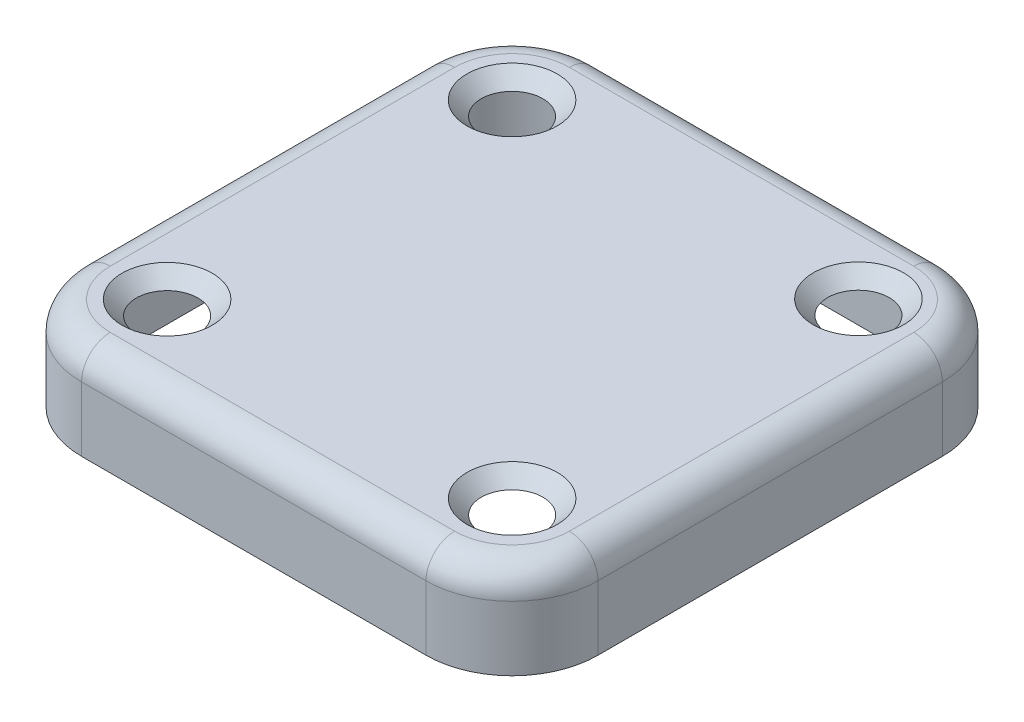
ISO-10303-21;
HEADER;
FILE_DESCRIPTION(('STEP AP214'),'2;1');
FILE_NAME('part.step','',(''),(''),'','','');
FILE_SCHEMA(('AUTOMOTIVE_DESIGN { 1 0 10303 214 1 1 1 1 }'));
ENDSEC;
DATA;
#1=APPLICATION_CONTEXT('core data for automotive mechanical design processes');
#2=APPLICATION_PROTOCOL_DEFINITION('international standard','automotive_design',2000,#1);
#3=PRODUCT_CONTEXT('',#1,'mechanical');
#4=PRODUCT('Part','Part','',(#3));
#5=PRODUCT_RELATED_PRODUCT_CATEGORY('part','',(#4));
#6=PRODUCT_DEFINITION_FORMATION('','',#4);
#7=PRODUCT_DEFINITION_CONTEXT('part definition',#1,'design');
#8=PRODUCT_DEFINITION('design','',#6,#7);
#9=PRODUCT_DEFINITION_SHAPE('','',#8);
#10=(LENGTH_UNIT() NAMED_UNIT(*) SI_UNIT(.MILLI.,.METRE.));
#11=(NAMED_UNIT(*) PLANE_ANGLE_UNIT() SI_UNIT($,.RADIAN.));
#12=(NAMED_UNIT(*) SI_UNIT($,.STERADIAN.) SOLID_ANGLE_UNIT());
#13=UNCERTAINTY_MEASURE_WITH_UNIT(LENGTH_MEASURE(1.E-05),#10,'distance_accuracy_value','');
#14=(GEOMETRIC_REPRESENTATION_CONTEXT(3) GLOBAL_UNCERTAINTY_ASSIGNED_CONTEXT((#13)) GLOBAL_UNIT_ASSIGNED_CONTEXT((#10,
#11,#12)) REPRESENTATION_CONTEXT('',''));
#15=CARTESIAN_POINT('',(0.,0.,0.));
#16=DIRECTION('',(0.,0.,1.));
#17=DIRECTION('',(1.,0.,0.));
#18=AXIS2_PLACEMENT_3D('',#15,#16,#17);
#19=CARTESIAN_POINT('',(12.02,-1.,-12.02));
#20=DIRECTION('',(0.,1.,0.));
#21=DIRECTION('',(0.,0.,1.));
#22=AXIS2_PLACEMENT_3D('',#19,#20,#21);
#23=CYLINDRICAL_SURFACE('',#22,6.);
#24=DIRECTION('',(0.,1.,0.));
#25=VECTOR('',#24,1.);
#26=CARTESIAN_POINT('',(12.02,-1.,-18.02));
#27=LINE('',#26,#25);
#28=CARTESIAN_POINT('',(12.02,-6.5,-18.02));
#29=VERTEX_POINT('',#28);
#30=CARTESIAN_POINT('',(12.02,-2.,-18.02));
#31=VERTEX_POINT('',#30);
#32=EDGE_CURVE('E387',#29,#31,#27,.T.);
#33=ORIENTED_EDGE('',*,*,#32,.T.);
#34=CARTESIAN_POINT('',(12.02,-2.,-12.02));
#35=DIRECTION('',(0.,1.,0.));
#36=DIRECTION('',(0.,0.,1.));
#37=AXIS2_PLACEMENT_3D('',#34,#35,#36);
#38=CIRCLE('',#37,6.);
#39=CARTESIAN_POINT('',(18.02,-2.,-12.02));
#40=VERTEX_POINT('',#39);
#41=EDGE_CURVE('E444',#31,#40,#38,.F.);
#42=ORIENTED_EDGE('',*,*,#41,.T.);
#43=DIRECTION('',(0.,1.,0.));
#44=VECTOR('',#43,1.);
#45=CARTESIAN_POINT('',(18.02,-1.,-12.02));
#46=LINE('',#45,#44);
#47=CARTESIAN_POINT('',(18.02,-6.5,-12.02));
#48=VERTEX_POINT('',#47);
#49=EDGE_CURVE('E388',#48,#40,#46,.T.);
#50=ORIENTED_EDGE('',*,*,#49,.F.);
#51=CARTESIAN_POINT('',(12.02,-6.5,-12.02));
#52=DIRECTION('',(0.,-1.,0.));
#53=DIRECTION('',(0.,0.,-1.));
#54=AXIS2_PLACEMENT_3D('',#51,#52,#53);
#55=CIRCLE('',#54,6.);
#56=EDGE_CURVE('E327',#29,#48,#55,.T.);
#57=ORIENTED_EDGE('',*,*,#56,.F.);
#58=EDGE_LOOP('',(#33,#42,#50,#57));
#59=FACE_BOUND('',#58,.T.);
#60=ADVANCED_FACE('F89',(#59),#23,.T.);
#61=CARTESIAN_POINT('',(18.02,-1.,0.));
#62=DIRECTION('',(-1.,0.,0.));
#63=DIRECTION('',(0.,0.,1.));
#64=AXIS2_PLACEMENT_3D('',#61,#62,#63);
#65=PLANE('',#64);
#66=ORIENTED_EDGE('',*,*,#49,.T.);
#67=DIRECTION('',(0.,0.,1.));
#68=VECTOR('',#67,1.);
#69=CARTESIAN_POINT('',(18.02,-2.,12.02));
#70=LINE('',#69,#68);
#71=CARTESIAN_POINT('',(18.02,-2.,12.02));
#72=VERTEX_POINT('',#71);
#73=EDGE_CURVE('E466',#40,#72,#70,.T.);
#74=ORIENTED_EDGE('',*,*,#73,.T.);
#75=DIRECTION('',(0.,1.,0.));
#76=VECTOR('',#75,1.);
#77=CARTESIAN_POINT('',(18.02,-1.,12.02));
#78=LINE('',#77,#76);
#79=CARTESIAN_POINT('',(18.02,-6.5,12.02));
#80=VERTEX_POINT('',#79);
#81=EDGE_CURVE('E393',#80,#72,#78,.T.);
#82=ORIENTED_EDGE('',*,*,#81,.F.);
#83=DIRECTION('',(0.,0.,1.));
#84=VECTOR('',#83,1.);
#85=CARTESIAN_POINT('',(18.02,-6.5,-12.02));
#86=LINE('',#85,#84);
#87=EDGE_CURVE('E331',#48,#80,#86,.T.);
#88=ORIENTED_EDGE('',*,*,#87,.F.);
#89=EDGE_LOOP('',(#66,#74,#82,#88));
#90=FACE_BOUND('',#89,.T.);
#91=ADVANCED_FACE('F629',(#90),#65,.F.);
#92=CARTESIAN_POINT('',(12.02,-1.,12.02));
#93=DIRECTION('',(0.,1.,0.));
#94=DIRECTION('',(0.,0.,1.));
#95=AXIS2_PLACEMENT_3D('',#92,#93,#94);
#96=CYLINDRICAL_SURFACE('',#95,6.);
#97=ORIENTED_EDGE('',*,*,#81,.T.);
#98=CARTESIAN_POINT('',(12.02,-2.,12.02));
#99=DIRECTION('',(0.,1.,0.));
#100=DIRECTION('',(0.,0.,1.));
#101=AXIS2_PLACEMENT_3D('',#98,#99,#100);
#102=CIRCLE('',#101,6.);
#103=CARTESIAN_POINT('',(12.02,-2.,18.02));
#104=VERTEX_POINT('',#103);
#105=EDGE_CURVE('E463',#72,#104,#102,.F.);
#106=ORIENTED_EDGE('',*,*,#105,.T.);
#107=DIRECTION('',(0.,1.,0.));
#108=VECTOR('',#107,1.);
#109=CARTESIAN_POINT('',(12.02,-1.,18.02));
#110=LINE('',#109,#108);
#111=CARTESIAN_POINT('',(12.02,-6.5,18.02));
#112=VERTEX_POINT('',#111);
#113=EDGE_CURVE('E397',#112,#104,#110,.T.);
#114=ORIENTED_EDGE('',*,*,#113,.F.);
#115=CARTESIAN_POINT('',(12.02,-6.5,12.02));
#116=DIRECTION('',(0.,-1.,0.));
#117=DIRECTION('',(0.,0.,-1.));
#118=AXIS2_PLACEMENT_3D('',#115,#116,#117);
#119=CIRCLE('',#118,6.00000000000001);
#120=EDGE_CURVE('E335',#80,#112,#119,.T.);
#121=ORIENTED_EDGE('',*,*,#120,.F.);
#122=EDGE_LOOP('',(#97,#106,#114,#121));
#123=FACE_BOUND('',#122,.T.);
#124=ADVANCED_FACE('F635',(#123),#96,.T.);
#125=CARTESIAN_POINT('',(0.,-1.,18.02));
#126=DIRECTION('',(0.,0.,-1.));
#127=DIRECTION('',(-1.,0.,0.));
#128=AXIS2_PLACEMENT_3D('',#125,#126,#127);
#129=PLANE('',#128);
#130=ORIENTED_EDGE('',*,*,#113,.T.);
#131=DIRECTION('',(-1.,0.,0.));
#132=VECTOR('',#131,1.);
#133=CARTESIAN_POINT('',(-12.02,-2.,18.02));
#134=LINE('',#133,#132);
#135=CARTESIAN_POINT('',(-12.02,-2.,18.02));
#136=VERTEX_POINT('',#135);
#137=EDGE_CURVE('E460',#104,#136,#134,.T.);
#138=ORIENTED_EDGE('',*,*,#137,.T.);
#139=DIRECTION('',(0.,1.,0.));
#140=VECTOR('',#139,1.);
#141=CARTESIAN_POINT('',(-12.02,-1.,18.02));
#142=LINE('',#141,#140);
#143=CARTESIAN_POINT('',(-12.02,-6.5,18.02));
#144=VERTEX_POINT('',#143);
#145=EDGE_CURVE('E401',#144,#136,#142,.T.);
#146=ORIENTED_EDGE('',*,*,#145,.F.);
#147=DIRECTION('',(-1.,0.,0.));
#148=VECTOR('',#147,1.);
#149=CARTESIAN_POINT('',(12.02,-6.5,18.02));
#150=LINE('',#149,#148);
#151=EDGE_CURVE('E339',#112,#144,#150,.T.);
#152=ORIENTED_EDGE('',*,*,#151,.F.);
#153=EDGE_LOOP('',(#130,#138,#146,#152));
#154=FACE_BOUND('',#153,.T.);
#155=ADVANCED_FACE('F714',(#154),#129,.F.);
#156=CARTESIAN_POINT('',(-12.02,-1.,12.02));
#157=DIRECTION('',(0.,1.,0.));
#158=DIRECTION('',(0.,0.,1.));
#159=AXIS2_PLACEMENT_3D('',#156,#157,#158);
#160=CYLINDRICAL_SURFACE('',#159,5.99999999999999);
#161=ORIENTED_EDGE('',*,*,#145,.T.);
#162=CARTESIAN_POINT('',(-12.02,-2.,12.02));
#163=DIRECTION('',(0.,1.,0.));
#164=DIRECTION('',(0.,0.,1.));
#165=AXIS2_PLACEMENT_3D('',#162,#163,#164);
#166=CIRCLE('',#165,5.99999999999999);
#167=CARTESIAN_POINT('',(-18.02,-2.,12.02));
#168=VERTEX_POINT('',#167);
#169=EDGE_CURVE('E457',#136,#168,#166,.F.);
#170=ORIENTED_EDGE('',*,*,#169,.T.);
#171=DIRECTION('',(0.,1.,0.));
#172=VECTOR('',#171,1.);
#173=CARTESIAN_POINT('',(-18.02,-1.,12.02));
#174=LINE('',#173,#172);
#175=CARTESIAN_POINT('',(-18.02,-6.5,12.02));
#176=VERTEX_POINT('',#175);
#177=EDGE_CURVE('E405',#176,#168,#174,.T.);
#178=ORIENTED_EDGE('',*,*,#177,.F.);
#179=CARTESIAN_POINT('',(-12.02,-6.5,12.02));
#180=DIRECTION('',(0.,-1.,0.));
#181=DIRECTION('',(0.,0.,-1.));
#182=AXIS2_PLACEMENT_3D('',#179,#180,#181);
#183=CIRCLE('',#182,5.99999999999999);
#184=EDGE_CURVE('E343',#144,#176,#183,.T.);
#185=ORIENTED_EDGE('',*,*,#184,.F.);
#186=EDGE_LOOP('',(#161,#170,#178,#185));
#187=FACE_BOUND('',#186,.T.);
#188=ADVANCED_FACE('F718',(#187),#160,.T.);
#189=CARTESIAN_POINT('',(-18.02,-1.,0.));
#190=DIRECTION('',(-1.,0.,0.));
#191=DIRECTION('',(0.,0.,1.));
#192=AXIS2_PLACEMENT_3D('',#189,#190,#191);
#193=PLANE('',#192);
#194=ORIENTED_EDGE('',*,*,#177,.T.);
#195=DIRECTION('',(0.,0.,1.));
#196=VECTOR('',#195,1.);
#197=CARTESIAN_POINT('',(-18.02,-2.,0.));
#198=LINE('',#197,#196);
#199=CARTESIAN_POINT('',(-18.02,-2.,-12.02));
#200=VERTEX_POINT('',#199);
#201=EDGE_CURVE('E454',#168,#200,#198,.F.);
#202=ORIENTED_EDGE('',*,*,#201,.T.);
#203=DIRECTION('',(0.,1.,0.));
#204=VECTOR('',#203,1.);
#205=CARTESIAN_POINT('',(-18.02,-1.,-12.02));
#206=LINE('',#205,#204);
#207=CARTESIAN_POINT('',(-18.02,-6.5,-12.02));
#208=VERTEX_POINT('',#207);
#209=EDGE_CURVE('E409',#208,#200,#206,.T.);
#210=ORIENTED_EDGE('',*,*,#209,.F.);
#211=DIRECTION('',(0.,0.,-1.));
#212=VECTOR('',#211,1.);
#213=CARTESIAN_POINT('',(-18.02,-6.5,12.02));
#214=LINE('',#213,#212);
#215=EDGE_CURVE('E347',#176,#208,#214,.T.);
#216=ORIENTED_EDGE('',*,*,#215,.F.);
#217=EDGE_LOOP('',(#194,#202,#210,#216));
#218=FACE_BOUND('',#217,.T.);
#219=ADVANCED_FACE('F685',(#218),#193,.T.);
#220=CARTESIAN_POINT('',(-12.02,-1.,-12.02));
#221=DIRECTION('',(0.,1.,0.));
#222=DIRECTION('',(0.,0.,1.));
#223=AXIS2_PLACEMENT_3D('',#220,#221,#222);
#224=CYLINDRICAL_SURFACE('',#223,6.);
#225=ORIENTED_EDGE('',*,*,#209,.T.);
#226=CARTESIAN_POINT('',(-12.02,-2.,-12.02));
#227=DIRECTION('',(0.,1.,0.));
#228=DIRECTION('',(0.,0.,1.));
#229=AXIS2_PLACEMENT_3D('',#226,#227,#228);
#230=CIRCLE('',#229,6.);
#231=CARTESIAN_POINT('',(-12.02,-2.,-18.02));
#232=VERTEX_POINT('',#231);
#233=EDGE_CURVE('E451',#200,#232,#230,.F.);
#234=ORIENTED_EDGE('',*,*,#233,.T.);
#235=DIRECTION('',(0.,1.,0.));
#236=VECTOR('',#235,1.);
#237=CARTESIAN_POINT('',(-12.02,-1.,-18.02));
#238=LINE('',#237,#236);
#239=CARTESIAN_POINT('',(-12.02,-6.5,-18.02));
#240=VERTEX_POINT('',#239);
#241=EDGE_CURVE('E413',#240,#232,#238,.T.);
#242=ORIENTED_EDGE('',*,*,#241,.F.);
#243=CARTESIAN_POINT('',(-12.02,-6.5,-12.02));
#244=DIRECTION('',(0.,-1.,0.));
#245=DIRECTION('',(0.,0.,-1.));
#246=AXIS2_PLACEMENT_3D('',#243,#244,#245);
#247=CIRCLE('',#246,5.99999999999998);
#248=EDGE_CURVE('E351',#208,#240,#247,.T.);
#249=ORIENTED_EDGE('',*,*,#248,.F.);
#250=EDGE_LOOP('',(#225,#234,#242,#249));
#251=FACE_BOUND('',#250,.T.);
#252=ADVANCED_FACE('F689',(#251),#224,.T.);
#253=CARTESIAN_POINT('',(0.,-1.,-18.02));
#254=DIRECTION('',(0.,0.,-1.));
#255=DIRECTION('',(-1.,0.,0.));
#256=AXIS2_PLACEMENT_3D('',#253,#254,#255);
#257=PLANE('',#256);
#258=ORIENTED_EDGE('',*,*,#241,.T.);
#259=DIRECTION('',(-1.,0.,0.));
#260=VECTOR('',#259,1.);
#261=CARTESIAN_POINT('',(0.,-2.,-18.02));
#262=LINE('',#261,#260);
#263=EDGE_CURVE('E448',#232,#31,#262,.F.);
#264=ORIENTED_EDGE('',*,*,#263,.T.);
#265=ORIENTED_EDGE('',*,*,#32,.F.);
#266=DIRECTION('',(1.,0.,0.));
#267=VECTOR('',#266,1.);
#268=CARTESIAN_POINT('',(-12.02,-6.5,-18.02));
#269=LINE('',#268,#267);
#270=EDGE_CURVE('E274',#240,#29,#269,.T.);
#271=ORIENTED_EDGE('',*,*,#270,.F.);
#272=EDGE_LOOP('',(#258,#264,#265,#271));
#273=FACE_BOUND('',#272,.T.);
#274=ADVANCED_FACE('F640',(#273),#257,.T.);
#275=CARTESIAN_POINT('',(0.,-1.,0.));
#276=DIRECTION('',(0.,1.,0.));
#277=DIRECTION('',(0.,0.,1.));
#278=AXIS2_PLACEMENT_3D('',#275,#276,#277);
#279=PLANE('',#278);
#280=DIRECTION('',(1.,0.,0.));
#281=VECTOR('',#280,1.);
#282=CARTESIAN_POINT('',(0.,-1.,-16.02));
#283=LINE('',#282,#281);
#284=CARTESIAN_POINT('',(-12.02,-1.,-16.02));
#285=VERTEX_POINT('',#284);
#286=CARTESIAN_POINT('',(12.02,-1.,-16.02));
#287=VERTEX_POINT('',#286);
#288=EDGE_CURVE('E516',#285,#287,#283,.T.);
#289=ORIENTED_EDGE('',*,*,#288,.T.);
#290=CARTESIAN_POINT('',(12.02,-1.,-12.02));
#291=DIRECTION('',(0.,1.,0.));
#292=DIRECTION('',(0.,0.,1.));
#293=AXIS2_PLACEMENT_3D('',#290,#291,#292);
#294=CIRCLE('',#293,4.);
#295=CARTESIAN_POINT('',(16.02,-1.,-12.02));
#296=VERTEX_POINT('',#295);
#297=EDGE_CURVE('E519',#287,#296,#294,.F.);
#298=ORIENTED_EDGE('',*,*,#297,.T.);
#299=DIRECTION('',(0.,0.,1.));
#300=VECTOR('',#299,1.);
#301=CARTESIAN_POINT('',(16.02,-1.,0.));
#302=LINE('',#301,#300);
#303=CARTESIAN_POINT('',(16.02,-1.,12.02));
#304=VERTEX_POINT('',#303);
#305=EDGE_CURVE('E469',#296,#304,#302,.T.);
#306=ORIENTED_EDGE('',*,*,#305,.T.);
#307=CARTESIAN_POINT('',(12.02,-1.,12.02));
#308=DIRECTION('',(0.,1.,0.));
#309=DIRECTION('',(0.,0.,1.));
#310=AXIS2_PLACEMENT_3D('',#307,#308,#309);
#311=CIRCLE('',#310,4.00000000000001);
#312=CARTESIAN_POINT('',(12.02,-1.,16.02));
#313=VERTEX_POINT('',#312);
#314=EDGE_CURVE('E501',#304,#313,#311,.F.);
#315=ORIENTED_EDGE('',*,*,#314,.T.);
#316=DIRECTION('',(-1.,0.,0.));
#317=VECTOR('',#316,1.);
#318=CARTESIAN_POINT('',(0.,-1.,16.02));
#319=LINE('',#318,#317);
#320=CARTESIAN_POINT('',(-12.02,-1.,16.02));
#321=VERTEX_POINT('',#320);
#322=EDGE_CURVE('E504',#313,#321,#319,.T.);
#323=ORIENTED_EDGE('',*,*,#322,.T.);
#324=CARTESIAN_POINT('',(-12.02,-1.,12.02));
#325=DIRECTION('',(0.,1.,0.));
#326=DIRECTION('',(0.,0.,1.));
#327=AXIS2_PLACEMENT_3D('',#324,#325,#326);
#328=CIRCLE('',#327,3.99999999999999);
#329=CARTESIAN_POINT('',(-16.02,-1.,12.02));
#330=VERTEX_POINT('',#329);
#331=EDGE_CURVE('E507',#321,#330,#328,.F.);
#332=ORIENTED_EDGE('',*,*,#331,.T.);
#333=DIRECTION('',(0.,0.,-1.));
#334=VECTOR('',#333,1.);
#335=CARTESIAN_POINT('',(-16.02,-1.,0.));
#336=LINE('',#335,#334);
#337=CARTESIAN_POINT('',(-16.02,-1.,-12.02));
#338=VERTEX_POINT('',#337);
#339=EDGE_CURVE('E510',#330,#338,#336,.T.);
#340=ORIENTED_EDGE('',*,*,#339,.T.);
#341=CARTESIAN_POINT('',(-12.02,-1.,-12.02));
#342=DIRECTION('',(0.,1.,0.));
#343=DIRECTION('',(0.,0.,1.));
#344=AXIS2_PLACEMENT_3D('',#341,#342,#343);
#345=CIRCLE('',#344,3.99999999999998);
#346=EDGE_CURVE('E513',#338,#285,#345,.F.);
#347=ORIENTED_EDGE('',*,*,#346,.T.);
#348=EDGE_LOOP('',(#289,#298,#306,#315,#323,#332,#340,#347));
#349=FACE_BOUND('',#348,.T.);
#350=CARTESIAN_POINT('',(12.0621789360901,-1.,-12.1176225069458));
#351=DIRECTION('',(0.,1.,0.));
#352=DIRECTION('',(0.,0.,1.));
#353=AXIS2_PLACEMENT_3D('',#350,#351,#352);
#354=CIRCLE('',#353,2.15);
#355=CARTESIAN_POINT('',(12.0621789360901,-1.,-9.9676225069458));
#356=VERTEX_POINT('',#355);
#357=EDGE_CURVE('E359',#356,#356,#354,.T.);
#358=ORIENTED_EDGE('',*,*,#357,.T.);
#359=EDGE_LOOP('',(#358));
#360=FACE_BOUND('',#359,.T.);
#361=CARTESIAN_POINT('',(12.0445092973264,-1.,12.0344385611599));
#362=DIRECTION('',(0.,1.,0.));
#363=DIRECTION('',(0.,0.,1.));
#364=AXIS2_PLACEMENT_3D('',#361,#362,#363);
#365=CIRCLE('',#364,2.15);
#366=CARTESIAN_POINT('',(12.0445092973264,-1.,14.1844385611598));
#367=VERTEX_POINT('',#366);
#368=EDGE_CURVE('E367',#367,#367,#365,.T.);
#369=ORIENTED_EDGE('',*,*,#368,.T.);
#370=EDGE_LOOP('',(#369));
#371=FACE_BOUND('',#370,.T.);
#372=CARTESIAN_POINT('',(-12.045815229119,-1.,-12.0512050846424));
#373=DIRECTION('',(0.,1.,0.));
#374=DIRECTION('',(0.,0.,1.));
#375=AXIS2_PLACEMENT_3D('',#372,#373,#374);
#376=CIRCLE('',#375,2.15);
#377=CARTESIAN_POINT('',(-12.045815229119,-1.,-9.90120508464245));
#378=VERTEX_POINT('',#377);
#379=EDGE_CURVE('E375',#378,#378,#376,.T.);
#380=ORIENTED_EDGE('',*,*,#379,.T.);
#381=EDGE_LOOP('',(#380));
#382=FACE_BOUND('',#381,.T.);
#383=CARTESIAN_POINT('',(-12.0378632479606,-1.,12.033949606935));
#384=DIRECTION('',(0.,1.,0.));
#385=DIRECTION('',(0.,0.,1.));
#386=AXIS2_PLACEMENT_3D('',#383,#384,#385);
#387=CIRCLE('',#386,2.15);
#388=CARTESIAN_POINT('',(-12.0378632479606,-1.,14.183949606935));
#389=VERTEX_POINT('',#388);
#390=EDGE_CURVE('E383',#389,#389,#387,.T.);
#391=ORIENTED_EDGE('',*,*,#390,.T.);
#392=EDGE_LOOP('',(#391));
#393=FACE_BOUND('',#392,.T.);
#394=ADVANCED_FACE('F607',(#349,#360,#371,#382,#393),#279,.F.);
#395=CARTESIAN_POINT('',(0.,0.,0.));
#396=DIRECTION('',(0.,1.,0.));
#397=DIRECTION('',(0.,0.,1.));
#398=AXIS2_PLACEMENT_3D('',#395,#396,#397);
#399=PLANE('',#398);
#400=DIRECTION('',(0.,0.,1.));
#401=VECTOR('',#400,1.);
#402=CARTESIAN_POINT('',(16.02,0.,-12.02));
#403=LINE('',#402,#401);
#404=CARTESIAN_POINT('',(16.02,0.,12.02));
#405=VERTEX_POINT('',#404);
#406=CARTESIAN_POINT('',(16.02,0.,-12.02));
#407=VERTEX_POINT('',#406);
#408=EDGE_CURVE('E392',#405,#407,#403,.F.);
#409=ORIENTED_EDGE('',*,*,#408,.T.);
#410=CARTESIAN_POINT('',(12.02,0.,-12.02));
#411=DIRECTION('',(0.,1.,0.));
#412=DIRECTION('',(0.,0.,1.));
#413=AXIS2_PLACEMENT_3D('',#410,#411,#412);
#414=CIRCLE('',#413,4.);
#415=CARTESIAN_POINT('',(12.02,0.,-16.02));
#416=VERTEX_POINT('',#415);
#417=EDGE_CURVE('E440',#407,#416,#414,.T.);
#418=ORIENTED_EDGE('',*,*,#417,.T.);
#419=DIRECTION('',(-1.,0.,0.));
#420=VECTOR('',#419,1.);
#421=CARTESIAN_POINT('',(0.,0.,-16.02));
#422=LINE('',#421,#420);
#423=CARTESIAN_POINT('',(-12.02,0.,-16.02));
#424=VERTEX_POINT('',#423);
#425=EDGE_CURVE('E437',#416,#424,#422,.T.);
#426=ORIENTED_EDGE('',*,*,#425,.T.);
#427=CARTESIAN_POINT('',(-12.02,0.,-12.02));
#428=DIRECTION('',(0.,1.,0.));
#429=DIRECTION('',(0.,0.,1.));
#430=AXIS2_PLACEMENT_3D('',#427,#428,#429);
#431=CIRCLE('',#430,4.);
#432=CARTESIAN_POINT('',(-16.02,0.,-12.02));
#433=VERTEX_POINT('',#432);
#434=EDGE_CURVE('E434',#424,#433,#431,.T.);
#435=ORIENTED_EDGE('',*,*,#434,.T.);
#436=DIRECTION('',(0.,0.,1.));
#437=VECTOR('',#436,1.);
#438=CARTESIAN_POINT('',(-16.02,0.,0.));
#439=LINE('',#438,#437);
#440=CARTESIAN_POINT('',(-16.02,0.,12.02));
#441=VERTEX_POINT('',#440);
#442=EDGE_CURVE('E431',#433,#441,#439,.T.);
#443=ORIENTED_EDGE('',*,*,#442,.T.);
#444=CARTESIAN_POINT('',(-12.02,0.,12.02));
#445=DIRECTION('',(0.,1.,0.));
#446=DIRECTION('',(0.,0.,1.));
#447=AXIS2_PLACEMENT_3D('',#444,#445,#446);
#448=CIRCLE('',#447,3.99999999999999);
#449=CARTESIAN_POINT('',(-12.02,0.,16.02));
#450=VERTEX_POINT('',#449);
#451=EDGE_CURVE('E428',#441,#450,#448,.T.);
#452=ORIENTED_EDGE('',*,*,#451,.T.);
#453=DIRECTION('',(-1.,0.,0.));
#454=VECTOR('',#453,1.);
#455=CARTESIAN_POINT('',(12.02,0.,16.02));
#456=LINE('',#455,#454);
#457=CARTESIAN_POINT('',(12.02,0.,16.02));
#458=VERTEX_POINT('',#457);
#459=EDGE_CURVE('E425',#450,#458,#456,.F.);
#460=ORIENTED_EDGE('',*,*,#459,.T.);
#461=CARTESIAN_POINT('',(12.02,0.,12.02));
#462=DIRECTION('',(0.,1.,0.));
#463=DIRECTION('',(0.,0.,1.));
#464=AXIS2_PLACEMENT_3D('',#461,#462,#463);
#465=CIRCLE('',#464,4.);
#466=EDGE_CURVE('E422',#458,#405,#465,.T.);
#467=ORIENTED_EDGE('',*,*,#466,.T.);
#468=EDGE_LOOP('',(#409,#418,#426,#435,#443,#452,#460,#467));
#469=FACE_BOUND('',#468,.T.);
#470=CARTESIAN_POINT('',(12.0621789360901,0.,-12.1176225069458));
#471=DIRECTION('',(0.,1.,0.));
#472=DIRECTION('',(0.,0.,1.));
#473=AXIS2_PLACEMENT_3D('',#470,#471,#472);
#474=CIRCLE('',#473,3.15);
#475=CARTESIAN_POINT('',(12.0621789360901,0.,-8.9676225069458));
#476=VERTEX_POINT('',#475);
#477=EDGE_CURVE('E355',#476,#476,#474,.T.);
#478=ORIENTED_EDGE('',*,*,#477,.F.);
#479=EDGE_LOOP('',(#478));
#480=FACE_BOUND('',#479,.T.);
#481=CARTESIAN_POINT('',(12.0445092973264,0.,12.0344385611599));
#482=DIRECTION('',(0.,1.,0.));
#483=DIRECTION('',(0.,0.,1.));
#484=AXIS2_PLACEMENT_3D('',#481,#482,#483);
#485=CIRCLE('',#484,3.15);
#486=CARTESIAN_POINT('',(12.0445092973264,0.,15.1844385611599));
#487=VERTEX_POINT('',#486);
#488=EDGE_CURVE('E363',#487,#487,#485,.T.);
#489=ORIENTED_EDGE('',*,*,#488,.F.);
#490=EDGE_LOOP('',(#489));
#491=FACE_BOUND('',#490,.T.);
#492=CARTESIAN_POINT('',(-12.045815229119,0.,-12.0512050846424));
#493=DIRECTION('',(0.,1.,0.));
#494=DIRECTION('',(0.,0.,1.));
#495=AXIS2_PLACEMENT_3D('',#492,#493,#494);
#496=CIRCLE('',#495,3.15);
#497=CARTESIAN_POINT('',(-12.045815229119,0.,-8.90120508464245));
#498=VERTEX_POINT('',#497);
#499=EDGE_CURVE('E371',#498,#498,#496,.T.);
#500=ORIENTED_EDGE('',*,*,#499,.F.);
#501=EDGE_LOOP('',(#500));
#502=FACE_BOUND('',#501,.T.);
#503=CARTESIAN_POINT('',(-12.0378632479606,0.,12.033949606935));
#504=DIRECTION('',(0.,1.,0.));
#505=DIRECTION('',(0.,0.,1.));
#506=AXIS2_PLACEMENT_3D('',#503,#504,#505);
#507=CIRCLE('',#506,3.15);
#508=CARTESIAN_POINT('',(-12.0378632479606,0.,15.183949606935));
#509=VERTEX_POINT('',#508);
#510=EDGE_CURVE('E379',#509,#509,#507,.T.);
#511=ORIENTED_EDGE('',*,*,#510,.F.);
#512=EDGE_LOOP('',(#511));
#513=FACE_BOUND('',#512,.T.);
#514=ADVANCED_FACE('F709',(#469,#480,#491,#502,#513),#399,.T.);
#515=CARTESIAN_POINT('',(-12.0378632479606,0.,12.033949606935));
#516=DIRECTION('',(0.,1.,0.));
#517=DIRECTION('',(0.,0.,1.));
#518=AXIS2_PLACEMENT_3D('',#515,#516,#517);
#519=CONICAL_SURFACE('',#518,3.15,0.78539816339745);
#520=ORIENTED_EDGE('',*,*,#390,.F.);
#521=EDGE_LOOP('',(#520));
#522=FACE_BOUND('',#521,.T.);
#523=ORIENTED_EDGE('',*,*,#510,.T.);
#524=EDGE_LOOP('',(#523));
#525=FACE_BOUND('',#524,.T.);
#526=ADVANCED_FACE('F739',(#522,#525),#519,.F.);
#527=CARTESIAN_POINT('',(-12.045815229119,0.,-12.0512050846424));
#528=DIRECTION('',(0.,1.,0.));
#529=DIRECTION('',(0.,0.,1.));
#530=AXIS2_PLACEMENT_3D('',#527,#528,#529);
#531=CONICAL_SURFACE('',#530,3.15,0.78539816339745);
#532=ORIENTED_EDGE('',*,*,#379,.F.);
#533=EDGE_LOOP('',(#532));
#534=FACE_BOUND('',#533,.T.);
#535=ORIENTED_EDGE('',*,*,#499,.T.);
#536=EDGE_LOOP('',(#535));
#537=FACE_BOUND('',#536,.T.);
#538=ADVANCED_FACE('F969',(#534,#537),#531,.F.);
#539=CARTESIAN_POINT('',(12.0445092973264,0.,12.0344385611599));
#540=DIRECTION('',(0.,1.,0.));
#541=DIRECTION('',(0.,0.,1.));
#542=AXIS2_PLACEMENT_3D('',#539,#540,#541);
#543=CONICAL_SURFACE('',#542,3.15,0.78539816339745);
#544=ORIENTED_EDGE('',*,*,#368,.F.);
#545=EDGE_LOOP('',(#544));
#546=FACE_BOUND('',#545,.T.);
#547=ORIENTED_EDGE('',*,*,#488,.T.);
#548=EDGE_LOOP('',(#547));
#549=FACE_BOUND('',#548,.T.);
#550=ADVANCED_FACE('F966',(#546,#549),#543,.F.);
#551=CARTESIAN_POINT('',(12.0621789360901,0.,-12.1176225069458));
#552=DIRECTION('',(0.,1.,0.));
#553=DIRECTION('',(0.,0.,1.));
#554=AXIS2_PLACEMENT_3D('',#551,#552,#553);
#555=CONICAL_SURFACE('',#554,3.15,0.78539816339745);
#556=ORIENTED_EDGE('',*,*,#357,.F.);
#557=EDGE_LOOP('',(#556));
#558=FACE_BOUND('',#557,.T.);
#559=ORIENTED_EDGE('',*,*,#477,.T.);
#560=EDGE_LOOP('',(#559));
#561=FACE_BOUND('',#560,.T.);
#562=ADVANCED_FACE('F963',(#558,#561),#555,.F.);
#563=CARTESIAN_POINT('',(12.02,-6.5,-12.02));
#564=DIRECTION('',(0.,-1.,0.));
#565=DIRECTION('',(0.,0.,-1.));
#566=AXIS2_PLACEMENT_3D('',#563,#564,#565);
#567=PLANE('',#566);
#568=ORIENTED_EDGE('',*,*,#270,.T.);
#569=ORIENTED_EDGE('',*,*,#56,.T.);
#570=ORIENTED_EDGE('',*,*,#87,.T.);
#571=ORIENTED_EDGE('',*,*,#120,.T.);
#572=ORIENTED_EDGE('',*,*,#151,.T.);
#573=ORIENTED_EDGE('',*,*,#184,.T.);
#574=ORIENTED_EDGE('',*,*,#215,.T.);
#575=ORIENTED_EDGE('',*,*,#248,.T.);
#576=EDGE_LOOP('',(#568,#569,#570,#571,#572,#573,#574,#575));
#577=FACE_BOUND('',#576,.T.);
#578=DIRECTION('',(0.,0.,1.));
#579=VECTOR('',#578,1.);
#580=CARTESIAN_POINT('',(17.02,-6.5,-12.02));
#581=LINE('',#580,#579);
#582=CARTESIAN_POINT('',(17.02,-6.5,-12.02));
#583=VERTEX_POINT('',#582);
#584=CARTESIAN_POINT('',(17.02,-6.5,12.02));
#585=VERTEX_POINT('',#584);
#586=EDGE_CURVE('E267',#583,#585,#581,.T.);
#587=ORIENTED_EDGE('',*,*,#586,.F.);
#588=CARTESIAN_POINT('',(12.02,-6.5,-12.02));
#589=DIRECTION('',(0.,-1.,0.));
#590=DIRECTION('',(0.,0.,-1.));
#591=AXIS2_PLACEMENT_3D('',#588,#589,#590);
#592=CIRCLE('',#591,5.);
#593=CARTESIAN_POINT('',(12.02,-6.5,-17.02));
#594=VERTEX_POINT('',#593);
#595=EDGE_CURVE('E255',#594,#583,#592,.T.);
#596=ORIENTED_EDGE('',*,*,#595,.F.);
#597=DIRECTION('',(1.,0.,0.));
#598=VECTOR('',#597,1.);
#599=CARTESIAN_POINT('',(-12.02,-6.5,-17.02));
#600=LINE('',#599,#598);
#601=CARTESIAN_POINT('',(-12.02,-6.5,-17.02));
#602=VERTEX_POINT('',#601);
#603=EDGE_CURVE('E299',#602,#594,#600,.T.);
#604=ORIENTED_EDGE('',*,*,#603,.F.);
#605=CARTESIAN_POINT('',(-12.02,-6.5,-12.02));
#606=DIRECTION('',(0.,-1.,0.));
#607=DIRECTION('',(0.,0.,-1.));
#608=AXIS2_PLACEMENT_3D('',#605,#606,#607);
#609=CIRCLE('',#608,4.99999999999998);
#610=CARTESIAN_POINT('',(-17.02,-6.5,-12.02));
#611=VERTEX_POINT('',#610);
#612=EDGE_CURVE('E295',#611,#602,#609,.T.);
#613=ORIENTED_EDGE('',*,*,#612,.F.);
#614=DIRECTION('',(0.,0.,-1.));
#615=VECTOR('',#614,1.);
#616=CARTESIAN_POINT('',(-17.02,-6.5,12.02));
#617=LINE('',#616,#615);
#618=CARTESIAN_POINT('',(-17.02,-6.5,12.02));
#619=VERTEX_POINT('',#618);
#620=EDGE_CURVE('E292',#619,#611,#617,.T.);
#621=ORIENTED_EDGE('',*,*,#620,.F.);
#622=CARTESIAN_POINT('',(-12.02,-6.5,12.02));
#623=DIRECTION('',(0.,-1.,0.));
#624=DIRECTION('',(0.,0.,-1.));
#625=AXIS2_PLACEMENT_3D('',#622,#623,#624);
#626=CIRCLE('',#625,4.99999999999999);
#627=CARTESIAN_POINT('',(-12.02,-6.5,17.02));
#628=VERTEX_POINT('',#627);
#629=EDGE_CURVE('E289',#628,#619,#626,.T.);
#630=ORIENTED_EDGE('',*,*,#629,.F.);
#631=DIRECTION('',(-1.,0.,0.));
#632=VECTOR('',#631,1.);
#633=CARTESIAN_POINT('',(12.02,-6.5,17.02));
#634=LINE('',#633,#632);
#635=CARTESIAN_POINT('',(12.02,-6.5,17.02));
#636=VERTEX_POINT('',#635);
#637=EDGE_CURVE('E284',#636,#628,#634,.T.);
#638=ORIENTED_EDGE('',*,*,#637,.F.);
#639=CARTESIAN_POINT('',(12.02,-6.5,12.02));
#640=DIRECTION('',(0.,-1.,0.));
#641=DIRECTION('',(0.,0.,-1.));
#642=AXIS2_PLACEMENT_3D('',#639,#640,#641);
#643=CIRCLE('',#642,5.00000000000001);
#644=EDGE_CURVE('E280',#585,#636,#643,.T.);
#645=ORIENTED_EDGE('',*,*,#644,.F.);
#646=EDGE_LOOP('',(#587,#596,#604,#613,#621,#630,#638,#645));
#647=FACE_BOUND('',#646,.T.);
#648=ADVANCED_FACE('F278',(#577,#647),#567,.T.);
#649=CARTESIAN_POINT('',(12.02,-6.5,-12.02));
#650=DIRECTION('',(0.,1.,0.));
#651=DIRECTION('',(0.,0.,1.));
#652=AXIS2_PLACEMENT_3D('',#649,#650,#651);
#653=CYLINDRICAL_SURFACE('',#652,5.);
#654=DIRECTION('',(0.,1.,0.));
#655=VECTOR('',#654,1.);
#656=CARTESIAN_POINT('',(17.02,-6.5,-12.02));
#657=LINE('',#656,#655);
#658=CARTESIAN_POINT('',(17.02,-2.,-12.02));
#659=VERTEX_POINT('',#658);
#660=EDGE_CURVE('E259',#583,#659,#657,.T.);
#661=ORIENTED_EDGE('',*,*,#660,.T.);
#662=CARTESIAN_POINT('',(12.02,-2.,-12.02));
#663=DIRECTION('',(0.,1.,0.));
#664=DIRECTION('',(0.,0.,1.));
#665=AXIS2_PLACEMENT_3D('',#662,#663,#664);
#666=CIRCLE('',#665,5.);
#667=CARTESIAN_POINT('',(12.02,-2.,-17.02));
#668=VERTEX_POINT('',#667);
#669=EDGE_CURVE('E523',#659,#668,#666,.T.);
#670=ORIENTED_EDGE('',*,*,#669,.T.);
#671=DIRECTION('',(0.,1.,0.));
#672=VECTOR('',#671,1.);
#673=CARTESIAN_POINT('',(12.02,-6.5,-17.02));
#674=LINE('',#673,#672);
#675=EDGE_CURVE('E262',#594,#668,#674,.T.);
#676=ORIENTED_EDGE('',*,*,#675,.F.);
#677=ORIENTED_EDGE('',*,*,#595,.T.);
#678=EDGE_LOOP('',(#661,#670,#676,#677));
#679=FACE_BOUND('',#678,.T.);
#680=ADVANCED_FACE('F257',(#679),#653,.F.);
#681=CARTESIAN_POINT('',(17.02,-6.5,-12.02));
#682=DIRECTION('',(-1.,0.,0.));
#683=DIRECTION('',(0.,0.,1.));
#684=AXIS2_PLACEMENT_3D('',#681,#682,#683);
#685=PLANE('',#684);
#686=DIRECTION('',(0.,1.,0.));
#687=VECTOR('',#686,1.);
#688=CARTESIAN_POINT('',(17.02,-6.5,12.02));
#689=LINE('',#688,#687);
#690=CARTESIAN_POINT('',(17.02,-2.,12.02));
#691=VERTEX_POINT('',#690);
#692=EDGE_CURVE('E275',#585,#691,#689,.T.);
#693=ORIENTED_EDGE('',*,*,#692,.T.);
#694=DIRECTION('',(0.,0.,1.));
#695=VECTOR('',#694,1.);
#696=CARTESIAN_POINT('',(17.02,-2.,-12.02));
#697=LINE('',#696,#695);
#698=EDGE_CURVE('E12',#691,#659,#697,.F.);
#699=ORIENTED_EDGE('',*,*,#698,.T.);
#700=ORIENTED_EDGE('',*,*,#660,.F.);
#701=ORIENTED_EDGE('',*,*,#586,.T.);
#702=EDGE_LOOP('',(#693,#699,#700,#701));
#703=FACE_BOUND('',#702,.T.);
#704=ADVANCED_FACE('F271',(#703),#685,.T.);
#705=CARTESIAN_POINT('',(12.02,-6.5,12.02));
#706=DIRECTION('',(0.,1.,0.));
#707=DIRECTION('',(0.,0.,1.));
#708=AXIS2_PLACEMENT_3D('',#705,#706,#707);
#709=CYLINDRICAL_SURFACE('',#708,5.00000000000001);
#710=DIRECTION('',(0.,1.,0.));
#711=VECTOR('',#710,1.);
#712=CARTESIAN_POINT('',(12.02,-6.5,17.02));
#713=LINE('',#712,#711);
#714=CARTESIAN_POINT('',(12.02,-2.,17.02));
#715=VERTEX_POINT('',#714);
#716=EDGE_CURVE('E319',#636,#715,#713,.T.);
#717=ORIENTED_EDGE('',*,*,#716,.T.);
#718=CARTESIAN_POINT('',(12.02,-2.,12.02));
#719=DIRECTION('',(0.,1.,0.));
#720=DIRECTION('',(0.,0.,1.));
#721=AXIS2_PLACEMENT_3D('',#718,#719,#720);
#722=CIRCLE('',#721,5.00000000000001);
#723=EDGE_CURVE('E99',#715,#691,#722,.T.);
#724=ORIENTED_EDGE('',*,*,#723,.T.);
#725=ORIENTED_EDGE('',*,*,#692,.F.);
#726=ORIENTED_EDGE('',*,*,#644,.T.);
#727=EDGE_LOOP('',(#717,#724,#725,#726));
#728=FACE_BOUND('',#727,.T.);
#729=ADVANCED_FACE('F858',(#728),#709,.F.);
#730=CARTESIAN_POINT('',(12.02,-6.5,17.02));
#731=DIRECTION('',(0.,0.,-1.));
#732=DIRECTION('',(-1.,0.,0.));
#733=AXIS2_PLACEMENT_3D('',#730,#731,#732);
#734=PLANE('',#733);
#735=DIRECTION('',(0.,1.,0.));
#736=VECTOR('',#735,1.);
#737=CARTESIAN_POINT('',(-12.02,-6.5,17.02));
#738=LINE('',#737,#736);
#739=CARTESIAN_POINT('',(-12.02,-2.,17.02));
#740=VERTEX_POINT('',#739);
#741=EDGE_CURVE('E316',#628,#740,#738,.T.);
#742=ORIENTED_EDGE('',*,*,#741,.T.);
#743=DIRECTION('',(-1.,0.,0.));
#744=VECTOR('',#743,1.);
#745=CARTESIAN_POINT('',(12.02,-2.,17.02));
#746=LINE('',#745,#744);
#747=EDGE_CURVE('E114',#740,#715,#746,.F.);
#748=ORIENTED_EDGE('',*,*,#747,.T.);
#749=ORIENTED_EDGE('',*,*,#716,.F.);
#750=ORIENTED_EDGE('',*,*,#637,.T.);
#751=EDGE_LOOP('',(#742,#748,#749,#750));
#752=FACE_BOUND('',#751,.T.);
#753=ADVANCED_FACE('F585',(#752),#734,.T.);
#754=CARTESIAN_POINT('',(-12.02,-6.5,12.02));
#755=DIRECTION('',(0.,1.,0.));
#756=DIRECTION('',(0.,0.,1.));
#757=AXIS2_PLACEMENT_3D('',#754,#755,#756);
#758=CYLINDRICAL_SURFACE('',#757,4.99999999999999);
#759=DIRECTION('',(0.,1.,0.));
#760=VECTOR('',#759,1.);
#761=CARTESIAN_POINT('',(-17.02,-6.5,12.02));
#762=LINE('',#761,#760);
#763=CARTESIAN_POINT('',(-17.02,-2.,12.02));
#764=VERTEX_POINT('',#763);
#765=EDGE_CURVE('E312',#619,#764,#762,.T.);
#766=ORIENTED_EDGE('',*,*,#765,.T.);
#767=CARTESIAN_POINT('',(-12.02,-2.,12.02));
#768=DIRECTION('',(0.,1.,0.));
#769=DIRECTION('',(0.,0.,1.));
#770=AXIS2_PLACEMENT_3D('',#767,#768,#769);
#771=CIRCLE('',#770,4.99999999999999);
#772=EDGE_CURVE('E535',#764,#740,#771,.T.);
#773=ORIENTED_EDGE('',*,*,#772,.T.);
#774=ORIENTED_EDGE('',*,*,#741,.F.);
#775=ORIENTED_EDGE('',*,*,#629,.T.);
#776=EDGE_LOOP('',(#766,#773,#774,#775));
#777=FACE_BOUND('',#776,.T.);
#778=ADVANCED_FACE('F582',(#777),#758,.F.);
#779=CARTESIAN_POINT('',(-17.02,-6.5,12.02));
#780=DIRECTION('',(1.,0.,0.));
#781=DIRECTION('',(0.,0.,-1.));
#782=AXIS2_PLACEMENT_3D('',#779,#780,#781);
#783=PLANE('',#782);
#784=DIRECTION('',(0.,1.,0.));
#785=VECTOR('',#784,1.);
#786=CARTESIAN_POINT('',(-17.02,-6.5,-12.02));
#787=LINE('',#786,#785);
#788=CARTESIAN_POINT('',(-17.02,-2.,-12.02));
#789=VERTEX_POINT('',#788);
#790=EDGE_CURVE('E308',#611,#789,#787,.T.);
#791=ORIENTED_EDGE('',*,*,#790,.T.);
#792=DIRECTION('',(0.,0.,-1.));
#793=VECTOR('',#792,1.);
#794=CARTESIAN_POINT('',(-17.02,-2.,12.02));
#795=LINE('',#794,#793);
#796=EDGE_CURVE('E532',#789,#764,#795,.F.);
#797=ORIENTED_EDGE('',*,*,#796,.T.);
#798=ORIENTED_EDGE('',*,*,#765,.F.);
#799=ORIENTED_EDGE('',*,*,#620,.T.);
#800=EDGE_LOOP('',(#791,#797,#798,#799));
#801=FACE_BOUND('',#800,.T.);
#802=ADVANCED_FACE('F589',(#801),#783,.T.);
#803=CARTESIAN_POINT('',(-12.02,-6.5,-12.02));
#804=DIRECTION('',(0.,1.,0.));
#805=DIRECTION('',(0.,0.,1.));
#806=AXIS2_PLACEMENT_3D('',#803,#804,#805);
#807=CYLINDRICAL_SURFACE('',#806,4.99999999999998);
#808=DIRECTION('',(0.,1.,0.));
#809=VECTOR('',#808,1.);
#810=CARTESIAN_POINT('',(-12.02,-6.5,-17.02));
#811=LINE('',#810,#809);
#812=CARTESIAN_POINT('',(-12.02,-2.,-17.02));
#813=VERTEX_POINT('',#812);
#814=EDGE_CURVE('E304',#602,#813,#811,.T.);
#815=ORIENTED_EDGE('',*,*,#814,.T.);
#816=CARTESIAN_POINT('',(-12.02,-2.,-12.02));
#817=DIRECTION('',(0.,1.,0.));
#818=DIRECTION('',(0.,0.,1.));
#819=AXIS2_PLACEMENT_3D('',#816,#817,#818);
#820=CIRCLE('',#819,4.99999999999998);
#821=EDGE_CURVE('E529',#813,#789,#820,.T.);
#822=ORIENTED_EDGE('',*,*,#821,.T.);
#823=ORIENTED_EDGE('',*,*,#790,.F.);
#824=ORIENTED_EDGE('',*,*,#612,.T.);
#825=EDGE_LOOP('',(#815,#822,#823,#824));
#826=FACE_BOUND('',#825,.T.);
#827=ADVANCED_FACE('F592',(#826),#807,.F.);
#828=CARTESIAN_POINT('',(-12.02,-6.5,-17.02));
#829=DIRECTION('',(0.,0.,1.));
#830=DIRECTION('',(1.,0.,0.));
#831=AXIS2_PLACEMENT_3D('',#828,#829,#830);
#832=PLANE('',#831);
#833=ORIENTED_EDGE('',*,*,#675,.T.);
#834=DIRECTION('',(1.,0.,0.));
#835=VECTOR('',#834,1.);
#836=CARTESIAN_POINT('',(-12.02,-2.,-17.02));
#837=LINE('',#836,#835);
#838=EDGE_CURVE('E526',#668,#813,#837,.F.);
#839=ORIENTED_EDGE('',*,*,#838,.T.);
#840=ORIENTED_EDGE('',*,*,#814,.F.);
#841=ORIENTED_EDGE('',*,*,#603,.T.);
#842=EDGE_LOOP('',(#833,#839,#840,#841));
#843=FACE_BOUND('',#842,.T.);
#844=ADVANCED_FACE('F595',(#843),#832,.T.);
#845=CARTESIAN_POINT('',(-12.02,-2.,12.02));
#846=DIRECTION('',(0.,1.,0.));
#847=DIRECTION('',(0.,0.,1.));
#848=AXIS2_PLACEMENT_3D('',#845,#846,#847);
#849=TOROIDAL_SURFACE('',#848,3.99999999999999,2.);
#850=CARTESIAN_POINT('',(-16.02,-2.,12.02));
#851=DIRECTION('',(0.,0.,-1.));
#852=DIRECTION('',(-1.,0.,0.));
#853=AXIS2_PLACEMENT_3D('',#850,#851,#852);
#854=CIRCLE('',#853,2.);
#855=EDGE_CURVE('E492',#168,#441,#854,.T.);
#856=ORIENTED_EDGE('',*,*,#855,.F.);
#857=ORIENTED_EDGE('',*,*,#169,.F.);
#858=CARTESIAN_POINT('',(-12.02,-2.,16.02));
#859=DIRECTION('',(1.,0.,0.));
#860=DIRECTION('',(0.,0.,-1.));
#861=AXIS2_PLACEMENT_3D('',#858,#859,#860);
#862=CIRCLE('',#861,2.);
#863=EDGE_CURVE('E268',#450,#136,#862,.T.);
#864=ORIENTED_EDGE('',*,*,#863,.F.);
#865=ORIENTED_EDGE('',*,*,#451,.F.);
#866=EDGE_LOOP('',(#856,#857,#864,#865));
#867=FACE_BOUND('',#866,.T.);
#868=ADVANCED_FACE('F668',(#867),#849,.T.);
#869=CARTESIAN_POINT('',(0.,-2.,16.02));
#870=DIRECTION('',(1.,0.,0.));
#871=DIRECTION('',(0.,0.,-1.));
#872=AXIS2_PLACEMENT_3D('',#869,#870,#871);
#873=CYLINDRICAL_SURFACE('',#872,2.);
#874=ORIENTED_EDGE('',*,*,#863,.T.);
#875=ORIENTED_EDGE('',*,*,#137,.F.);
#876=CARTESIAN_POINT('',(12.02,-2.,16.02));
#877=DIRECTION('',(1.,0.,0.));
#878=DIRECTION('',(0.,0.,-1.));
#879=AXIS2_PLACEMENT_3D('',#876,#877,#878);
#880=CIRCLE('',#879,2.);
#881=EDGE_CURVE('E488',#458,#104,#880,.T.);
#882=ORIENTED_EDGE('',*,*,#881,.F.);
#883=ORIENTED_EDGE('',*,*,#459,.F.);
#884=EDGE_LOOP('',(#874,#875,#882,#883));
#885=FACE_BOUND('',#884,.T.);
#886=ADVANCED_FACE('F665',(#885),#873,.T.);
#887=CARTESIAN_POINT('',(-16.02,-2.,0.));
#888=DIRECTION('',(0.,0.,1.));
#889=DIRECTION('',(1.,0.,0.));
#890=AXIS2_PLACEMENT_3D('',#887,#888,#889);
#891=CYLINDRICAL_SURFACE('',#890,2.);
#892=ORIENTED_EDGE('',*,*,#855,.T.);
#893=ORIENTED_EDGE('',*,*,#442,.F.);
#894=CARTESIAN_POINT('',(-16.02,-2.,-12.02));
#895=DIRECTION('',(0.,0.,-1.));
#896=DIRECTION('',(0.,1.,0.));
#897=AXIS2_PLACEMENT_3D('',#894,#895,#896);
#898=CIRCLE('',#897,2.);
#899=EDGE_CURVE('E484',#200,#433,#898,.T.);
#900=ORIENTED_EDGE('',*,*,#899,.F.);
#901=ORIENTED_EDGE('',*,*,#201,.F.);
#902=EDGE_LOOP('',(#892,#893,#900,#901));
#903=FACE_BOUND('',#902,.T.);
#904=ADVANCED_FACE('F661',(#903),#891,.T.);
#905=CARTESIAN_POINT('',(12.02,-2.,12.02));
#906=DIRECTION('',(0.,1.,0.));
#907=DIRECTION('',(0.,0.,1.));
#908=AXIS2_PLACEMENT_3D('',#905,#906,#907);
#909=TOROIDAL_SURFACE('',#908,4.,2.);
#910=ORIENTED_EDGE('',*,*,#881,.T.);
#911=ORIENTED_EDGE('',*,*,#105,.F.);
#912=CARTESIAN_POINT('',(16.02,-2.,12.02));
#913=DIRECTION('',(0.,0.,-1.));
#914=DIRECTION('',(-1.,0.,0.));
#915=AXIS2_PLACEMENT_3D('',#912,#913,#914);
#916=CIRCLE('',#915,2.);
#917=EDGE_CURVE('E480',#405,#72,#916,.T.);
#918=ORIENTED_EDGE('',*,*,#917,.F.);
#919=ORIENTED_EDGE('',*,*,#466,.F.);
#920=EDGE_LOOP('',(#910,#911,#918,#919));
#921=FACE_BOUND('',#920,.T.);
#922=ADVANCED_FACE('F657',(#921),#909,.T.);
#923=CARTESIAN_POINT('',(-12.02,-2.,-12.02));
#924=DIRECTION('',(0.,1.,0.));
#925=DIRECTION('',(0.,0.,1.));
#926=AXIS2_PLACEMENT_3D('',#923,#924,#925);
#927=TOROIDAL_SURFACE('',#926,4.,2.);
#928=ORIENTED_EDGE('',*,*,#899,.T.);
#929=ORIENTED_EDGE('',*,*,#434,.F.);
#930=CARTESIAN_POINT('',(-12.02,-2.,-16.02));
#931=DIRECTION('',(1.,0.,0.));
#932=DIRECTION('',(0.,0.,-1.));
#933=AXIS2_PLACEMENT_3D('',#930,#931,#932);
#934=CIRCLE('',#933,2.);
#935=EDGE_CURVE('E476',#232,#424,#934,.T.);
#936=ORIENTED_EDGE('',*,*,#935,.F.);
#937=ORIENTED_EDGE('',*,*,#233,.F.);
#938=EDGE_LOOP('',(#928,#929,#936,#937));
#939=FACE_BOUND('',#938,.T.);
#940=ADVANCED_FACE('F653',(#939),#927,.T.);
#941=CARTESIAN_POINT('',(16.02,-2.,0.));
#942=DIRECTION('',(0.,0.,-1.));
#943=DIRECTION('',(-1.,0.,0.));
#944=AXIS2_PLACEMENT_3D('',#941,#942,#943);
#945=CYLINDRICAL_SURFACE('',#944,2.);
#946=ORIENTED_EDGE('',*,*,#917,.T.);
#947=ORIENTED_EDGE('',*,*,#73,.F.);
#948=CARTESIAN_POINT('',(16.02,-2.,-12.02));
#949=DIRECTION('',(0.,0.,-1.));
#950=DIRECTION('',(-1.,0.,0.));
#951=AXIS2_PLACEMENT_3D('',#948,#949,#950);
#952=CIRCLE('',#951,2.);
#953=EDGE_CURVE('E473',#407,#40,#952,.T.);
#954=ORIENTED_EDGE('',*,*,#953,.F.);
#955=ORIENTED_EDGE('',*,*,#408,.F.);
#956=EDGE_LOOP('',(#946,#947,#954,#955));
#957=FACE_BOUND('',#956,.T.);
#958=ADVANCED_FACE('F649',(#957),#945,.T.);
#959=CARTESIAN_POINT('',(0.,-2.,-16.02));
#960=DIRECTION('',(-1.,0.,0.));
#961=DIRECTION('',(0.,0.,1.));
#962=AXIS2_PLACEMENT_3D('',#959,#960,#961);
#963=CYLINDRICAL_SURFACE('',#962,2.);
#964=ORIENTED_EDGE('',*,*,#935,.T.);
#965=ORIENTED_EDGE('',*,*,#425,.F.);
#966=CARTESIAN_POINT('',(12.02,-2.,-16.02));
#967=DIRECTION('',(1.,0.,0.));
#968=DIRECTION('',(0.,1.,0.));
#969=AXIS2_PLACEMENT_3D('',#966,#967,#968);
#970=CIRCLE('',#969,2.);
#971=EDGE_CURVE('E470',#31,#416,#970,.T.);
#972=ORIENTED_EDGE('',*,*,#971,.F.);
#973=ORIENTED_EDGE('',*,*,#263,.F.);
#974=EDGE_LOOP('',(#964,#965,#972,#973));
#975=FACE_BOUND('',#974,.T.);
#976=ADVANCED_FACE('F645',(#975),#963,.T.);
#977=CARTESIAN_POINT('',(12.02,-2.,-12.02));
#978=DIRECTION('',(0.,1.,0.));
#979=DIRECTION('',(0.,0.,1.));
#980=AXIS2_PLACEMENT_3D('',#977,#978,#979);
#981=TOROIDAL_SURFACE('',#980,4.,2.);
#982=ORIENTED_EDGE('',*,*,#953,.T.);
#983=ORIENTED_EDGE('',*,*,#41,.F.);
#984=ORIENTED_EDGE('',*,*,#971,.T.);
#985=ORIENTED_EDGE('',*,*,#417,.F.);
#986=EDGE_LOOP('',(#982,#983,#984,#985));
#987=FACE_BOUND('',#986,.T.);
#988=ADVANCED_FACE('F642',(#987),#981,.T.);
#989=CARTESIAN_POINT('',(-12.02,-2.,12.02));
#990=DIRECTION('',(0.,1.,0.));
#991=DIRECTION('',(0.,0.,1.));
#992=AXIS2_PLACEMENT_3D('',#989,#990,#991);
#993=TOROIDAL_SURFACE('',#992,3.99999999999999,1.);
#994=CARTESIAN_POINT('',(-12.02,-2.,16.02));
#995=DIRECTION('',(-1.,0.,0.));
#996=DIRECTION('',(0.,0.,1.));
#997=AXIS2_PLACEMENT_3D('',#994,#995,#996);
#998=CIRCLE('',#997,1.);
#999=EDGE_CURVE('E563',#740,#321,#998,.T.);
#1000=ORIENTED_EDGE('',*,*,#999,.F.);
#1001=ORIENTED_EDGE('',*,*,#772,.F.);
#1002=CARTESIAN_POINT('',(-16.02,-2.,12.02));
#1003=DIRECTION('',(0.,0.,1.));
#1004=DIRECTION('',(1.,0.,0.));
#1005=AXIS2_PLACEMENT_3D('',#1002,#1003,#1004);
#1006=CIRCLE('',#1005,1.);
#1007=EDGE_CURVE('E93',#330,#764,#1006,.T.);
#1008=ORIENTED_EDGE('',*,*,#1007,.F.);
#1009=ORIENTED_EDGE('',*,*,#331,.F.);
#1010=EDGE_LOOP('',(#1000,#1001,#1008,#1009));
#1011=FACE_BOUND('',#1010,.T.);
#1012=ADVANCED_FACE('F91',(#1011),#993,.F.);
#1013=CARTESIAN_POINT('',(-16.02,-2.,0.));
#1014=DIRECTION('',(0.,0.,-1.));
#1015=DIRECTION('',(-1.,0.,0.));
#1016=AXIS2_PLACEMENT_3D('',#1013,#1014,#1015);
#1017=CYLINDRICAL_SURFACE('',#1016,1.);
#1018=ORIENTED_EDGE('',*,*,#1007,.T.);
#1019=ORIENTED_EDGE('',*,*,#796,.F.);
#1020=CARTESIAN_POINT('',(-16.02,-2.,-12.02));
#1021=DIRECTION('',(0.,0.,1.));
#1022=DIRECTION('',(1.,0.,0.));
#1023=AXIS2_PLACEMENT_3D('',#1020,#1021,#1022);
#1024=CIRCLE('',#1023,1.);
#1025=EDGE_CURVE('E560',#338,#789,#1024,.T.);
#1026=ORIENTED_EDGE('',*,*,#1025,.F.);
#1027=ORIENTED_EDGE('',*,*,#339,.F.);
#1028=EDGE_LOOP('',(#1018,#1019,#1026,#1027));
#1029=FACE_BOUND('',#1028,.T.);
#1030=ADVANCED_FACE('F575',(#1029),#1017,.F.);
#1031=CARTESIAN_POINT('',(0.,-2.,16.02));
#1032=DIRECTION('',(-1.,0.,0.));
#1033=DIRECTION('',(0.,0.,1.));
#1034=AXIS2_PLACEMENT_3D('',#1031,#1032,#1033);
#1035=CYLINDRICAL_SURFACE('',#1034,1.);
#1036=ORIENTED_EDGE('',*,*,#999,.T.);
#1037=ORIENTED_EDGE('',*,*,#322,.F.);
#1038=CARTESIAN_POINT('',(12.02,-2.,16.02));
#1039=DIRECTION('',(-1.,0.,0.));
#1040=DIRECTION('',(0.,0.,1.));
#1041=AXIS2_PLACEMENT_3D('',#1038,#1039,#1040);
#1042=CIRCLE('',#1041,1.);
#1043=EDGE_CURVE('E556',#715,#313,#1042,.T.);
#1044=ORIENTED_EDGE('',*,*,#1043,.F.);
#1045=ORIENTED_EDGE('',*,*,#747,.F.);
#1046=EDGE_LOOP('',(#1036,#1037,#1044,#1045));
#1047=FACE_BOUND('',#1046,.T.);
#1048=ADVANCED_FACE('F611',(#1047),#1035,.F.);
#1049=CARTESIAN_POINT('',(-12.02,-2.,-12.02));
#1050=DIRECTION('',(0.,1.,0.));
#1051=DIRECTION('',(0.,0.,1.));
#1052=AXIS2_PLACEMENT_3D('',#1049,#1050,#1051);
#1053=TOROIDAL_SURFACE('',#1052,3.99999999999998,1.);
#1054=ORIENTED_EDGE('',*,*,#1025,.T.);
#1055=ORIENTED_EDGE('',*,*,#821,.F.);
#1056=CARTESIAN_POINT('',(-12.02,-2.,-16.02));
#1057=DIRECTION('',(-1.,0.,0.));
#1058=DIRECTION('',(0.,0.,1.));
#1059=AXIS2_PLACEMENT_3D('',#1056,#1057,#1058);
#1060=CIRCLE('',#1059,1.);
#1061=EDGE_CURVE('E552',#285,#813,#1060,.T.);
#1062=ORIENTED_EDGE('',*,*,#1061,.F.);
#1063=ORIENTED_EDGE('',*,*,#346,.F.);
#1064=EDGE_LOOP('',(#1054,#1055,#1062,#1063));
#1065=FACE_BOUND('',#1064,.T.);
#1066=ADVANCED_FACE('F599',(#1065),#1053,.F.);
#1067=CARTESIAN_POINT('',(12.02,-2.,12.02));
#1068=DIRECTION('',(0.,1.,0.));
#1069=DIRECTION('',(0.,0.,1.));
#1070=AXIS2_PLACEMENT_3D('',#1067,#1068,#1069);
#1071=TOROIDAL_SURFACE('',#1070,4.00000000000001,1.);
#1072=ORIENTED_EDGE('',*,*,#1043,.T.);
#1073=ORIENTED_EDGE('',*,*,#314,.F.);
#1074=CARTESIAN_POINT('',(16.02,-2.,12.02));
#1075=DIRECTION('',(0.,0.,1.));
#1076=DIRECTION('',(1.,0.,0.));
#1077=AXIS2_PLACEMENT_3D('',#1074,#1075,#1076);
#1078=CIRCLE('',#1077,1.);
#1079=EDGE_CURVE('E548',#691,#304,#1078,.T.);
#1080=ORIENTED_EDGE('',*,*,#1079,.F.);
#1081=ORIENTED_EDGE('',*,*,#723,.F.);
#1082=EDGE_LOOP('',(#1072,#1073,#1080,#1081));
#1083=FACE_BOUND('',#1082,.T.);
#1084=ADVANCED_FACE('F613',(#1083),#1071,.F.);
#1085=CARTESIAN_POINT('',(0.,-2.,-16.02));
#1086=DIRECTION('',(1.,0.,0.));
#1087=DIRECTION('',(0.,0.,-1.));
#1088=AXIS2_PLACEMENT_3D('',#1085,#1086,#1087);
#1089=CYLINDRICAL_SURFACE('',#1088,1.);
#1090=ORIENTED_EDGE('',*,*,#1061,.T.);
#1091=ORIENTED_EDGE('',*,*,#838,.F.);
#1092=CARTESIAN_POINT('',(12.02,-2.,-16.02));
#1093=DIRECTION('',(-1.,0.,0.));
#1094=DIRECTION('',(0.,0.,1.));
#1095=AXIS2_PLACEMENT_3D('',#1092,#1093,#1094);
#1096=CIRCLE('',#1095,1.);
#1097=EDGE_CURVE('E545',#287,#668,#1096,.T.);
#1098=ORIENTED_EDGE('',*,*,#1097,.F.);
#1099=ORIENTED_EDGE('',*,*,#288,.F.);
#1100=EDGE_LOOP('',(#1090,#1091,#1098,#1099));
#1101=FACE_BOUND('',#1100,.T.);
#1102=ADVANCED_FACE('F603',(#1101),#1089,.F.);
#1103=CARTESIAN_POINT('',(16.02,-2.,0.));
#1104=DIRECTION('',(0.,0.,1.));
#1105=DIRECTION('',(1.,0.,0.));
#1106=AXIS2_PLACEMENT_3D('',#1103,#1104,#1105);
#1107=CYLINDRICAL_SURFACE('',#1106,1.);
#1108=ORIENTED_EDGE('',*,*,#1079,.T.);
#1109=ORIENTED_EDGE('',*,*,#305,.F.);
#1110=CARTESIAN_POINT('',(16.02,-2.,-12.02));
#1111=DIRECTION('',(0.,0.,1.));
#1112=DIRECTION('',(0.,-1.,0.));
#1113=AXIS2_PLACEMENT_3D('',#1110,#1111,#1112);
#1114=CIRCLE('',#1113,1.);
#1115=EDGE_CURVE('E542',#659,#296,#1114,.T.);
#1116=ORIENTED_EDGE('',*,*,#1115,.F.);
#1117=ORIENTED_EDGE('',*,*,#698,.F.);
#1118=EDGE_LOOP('',(#1108,#1109,#1116,#1117));
#1119=FACE_BOUND('',#1118,.T.);
#1120=ADVANCED_FACE('F618',(#1119),#1107,.F.);
#1121=CARTESIAN_POINT('',(12.02,-2.,-12.02));
#1122=DIRECTION('',(0.,1.,0.));
#1123=DIRECTION('',(0.,0.,1.));
#1124=AXIS2_PLACEMENT_3D('',#1121,#1122,#1123);
#1125=TOROIDAL_SURFACE('',#1124,4.,1.);
#1126=ORIENTED_EDGE('',*,*,#1097,.T.);
#1127=ORIENTED_EDGE('',*,*,#669,.F.);
#1128=ORIENTED_EDGE('',*,*,#1115,.T.);
#1129=ORIENTED_EDGE('',*,*,#297,.F.);
#1130=EDGE_LOOP('',(#1126,#1127,#1128,#1129));
#1131=FACE_BOUND('',#1130,.T.);
#1132=ADVANCED_FACE('F620',(#1131),#1125,.F.);
#1133=CLOSED_SHELL('',(#60,#91,#124,#155,#188,#219,#252,#274,#394,#514,#526,#538,#550,#562,#648,
#680,#704,#729,#753,#778,#802,#827,#844,#868,#886,#904,#922,#940,#958,#976,#988,#1012,#1030,
#1048,#1066,#1084,#1102,#1120,#1132));
#1134=MANIFOLD_SOLID_BREP('B2',#1133);
#1135=ADVANCED_BREP_SHAPE_REPRESENTATION('',(#18,#1134),#14);
#1136=SHAPE_DEFINITION_REPRESENTATION(#9,#1135);
ENDSEC;
END-ISO-10303-21;
